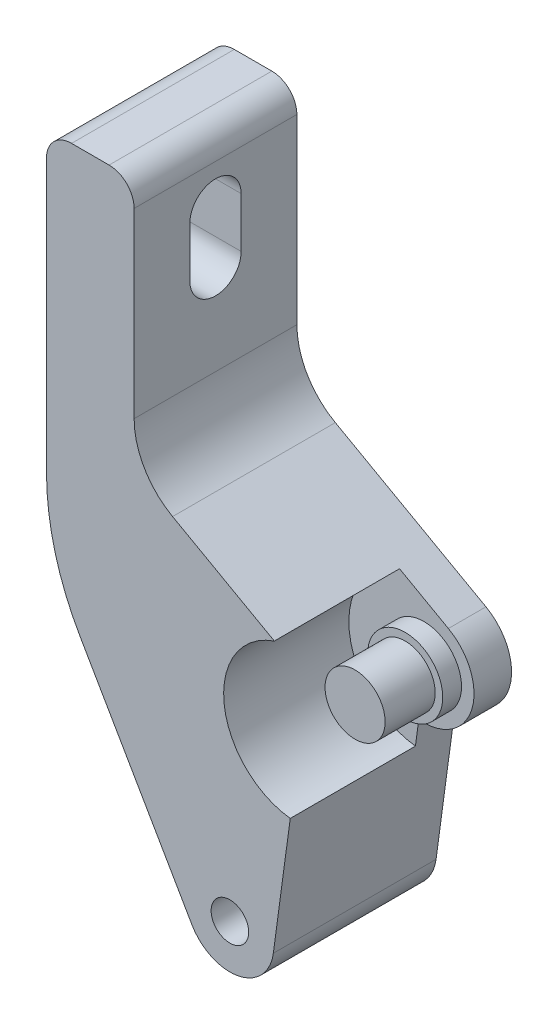
ISO-10303-21;
HEADER;
FILE_DESCRIPTION(('STEP AP214'),'2;1');
FILE_NAME('part.step','',(''),(''),'','','');
FILE_SCHEMA(('AUTOMOTIVE_DESIGN { 1 0 10303 214 1 1 1 1 }'));
ENDSEC;
DATA;
#1=APPLICATION_CONTEXT('core data for automotive mechanical design processes');
#2=APPLICATION_PROTOCOL_DEFINITION('international standard','automotive_design',2000,#1);
#3=PRODUCT_CONTEXT('',#1,'mechanical');
#4=PRODUCT('Part','Part','',(#3));
#5=PRODUCT_RELATED_PRODUCT_CATEGORY('part','',(#4));
#6=PRODUCT_DEFINITION_FORMATION('','',#4);
#7=PRODUCT_DEFINITION_CONTEXT('part definition',#1,'design');
#8=PRODUCT_DEFINITION('design','',#6,#7);
#9=PRODUCT_DEFINITION_SHAPE('','',#8);
#10=(LENGTH_UNIT() NAMED_UNIT(*) SI_UNIT(.MILLI.,.METRE.));
#11=(NAMED_UNIT(*) PLANE_ANGLE_UNIT() SI_UNIT($,.RADIAN.));
#12=(NAMED_UNIT(*) SI_UNIT($,.STERADIAN.) SOLID_ANGLE_UNIT());
#13=UNCERTAINTY_MEASURE_WITH_UNIT(LENGTH_MEASURE(1.E-05),#10,'distance_accuracy_value','');
#14=(GEOMETRIC_REPRESENTATION_CONTEXT(3) GLOBAL_UNCERTAINTY_ASSIGNED_CONTEXT((#13)) GLOBAL_UNIT_ASSIGNED_CONTEXT((#10,
#11,#12)) REPRESENTATION_CONTEXT('',''));
#15=CARTESIAN_POINT('',(0.,0.,0.));
#16=DIRECTION('',(0.,0.,1.));
#17=DIRECTION('',(1.,0.,0.));
#18=AXIS2_PLACEMENT_3D('',#15,#16,#17);
#19=CARTESIAN_POINT('',(-15.5,-15.5,3.));
#20=DIRECTION('',(0.,0.,1.));
#21=DIRECTION('',(1.,0.,0.));
#22=AXIS2_PLACEMENT_3D('',#19,#20,#21);
#23=PLANE('',#22);
#24=CARTESIAN_POINT('',(-10.,0.,3.));
#25=DIRECTION('',(0.,0.,1.));
#26=DIRECTION('',(1.,0.,0.));
#27=AXIS2_PLACEMENT_3D('',#24,#25,#26);
#28=CIRCLE('',#27,3.);
#29=CARTESIAN_POINT('',(-7.,0.,3.));
#30=VERTEX_POINT('',#29);
#31=EDGE_CURVE('E237',#30,#30,#28,.T.);
#32=ORIENTED_EDGE('',*,*,#31,.F.);
#33=EDGE_LOOP('',(#32));
#34=FACE_BOUND('',#33,.T.);
#35=DIRECTION('',(-0.872789761456183,0.488096335058213,0.));
#36=VECTOR('',#35,1.);
#37=CARTESIAN_POINT('',(-20.0785780103493,10.2193189967863,3.));
#38=LINE('',#37,#36);
#39=CARTESIAN_POINT('',(-8.04761465976715,3.49115904582473,3.));
#40=VERTEX_POINT('',#39);
#41=CARTESIAN_POINT('',(-11.9508491331308,5.67399221534209,3.));
#42=VERTEX_POINT('',#41);
#43=EDGE_CURVE('E252',#40,#42,#38,.T.);
#44=ORIENTED_EDGE('',*,*,#43,.T.);
#45=CARTESIAN_POINT('',(-10.,0.,3.));
#46=DIRECTION('',(0.,0.,-1.));
#47=DIRECTION('',(1.,0.,0.));
#48=AXIS2_PLACEMENT_3D('',#45,#46,#47);
#49=CIRCLE('',#48,6.);
#50=CARTESIAN_POINT('',(-10.6801845181552,-5.9613210802021,3.));
#51=VERTEX_POINT('',#50);
#52=EDGE_CURVE('E223',#51,#42,#49,.T.);
#53=ORIENTED_EDGE('',*,*,#52,.F.);
#54=DIRECTION('',(0.133819841401391,0.991005676092376,0.));
#55=VECTOR('',#54,1.);
#56=CARTESIAN_POINT('',(-12.0314801336767,-15.9683694449049,3.));
#57=LINE('',#56,#55);
#58=CARTESIAN_POINT('',(-10.4124595053815,-3.97867781510648,3.));
#59=VERTEX_POINT('',#58);
#60=EDGE_CURVE('E247',#51,#59,#57,.T.);
#61=ORIENTED_EDGE('',*,*,#60,.T.);
#62=CARTESIAN_POINT('',(-10.,0.,3.));
#63=DIRECTION('',(0.,0.,1.));
#64=DIRECTION('',(1.,0.,0.));
#65=AXIS2_PLACEMENT_3D('',#62,#63,#64);
#66=CIRCLE('',#65,4.);
#67=EDGE_CURVE('E249',#59,#40,#66,.T.);
#68=ORIENTED_EDGE('',*,*,#67,.T.);
#69=EDGE_LOOP('',(#44,#53,#61,#68));
#70=FACE_BOUND('',#69,.T.);
#71=ADVANCED_FACE('F35',(#34,#70),#23,.T.);
#72=CARTESIAN_POINT('',(0.,0.,4.5));
#73=DIRECTION('',(0.,0.,-1.));
#74=DIRECTION('',(-1.,0.,0.));
#75=AXIS2_PLACEMENT_3D('',#72,#73,#74);
#76=PLANE('',#75);
#77=CARTESIAN_POINT('',(-10.,0.,4.5));
#78=DIRECTION('',(0.,0.,-1.));
#79=DIRECTION('',(-1.,0.,0.));
#80=AXIS2_PLACEMENT_3D('',#77,#78,#79);
#81=CIRCLE('',#80,3.);
#82=CARTESIAN_POINT('',(-13.,0.,4.5));
#83=VERTEX_POINT('',#82);
#84=EDGE_CURVE('E240',#83,#83,#81,.T.);
#85=ORIENTED_EDGE('',*,*,#84,.F.);
#86=EDGE_LOOP('',(#85));
#87=FACE_BOUND('',#86,.T.);
#88=CARTESIAN_POINT('',(-10.,0.,4.5));
#89=DIRECTION('',(0.,0.,-1.));
#90=DIRECTION('',(-1.,0.,0.));
#91=AXIS2_PLACEMENT_3D('',#88,#89,#90);
#92=CIRCLE('',#91,2.4);
#93=CARTESIAN_POINT('',(-12.4,0.,4.5));
#94=VERTEX_POINT('',#93);
#95=EDGE_CURVE('E291',#94,#94,#92,.F.);
#96=ORIENTED_EDGE('',*,*,#95,.F.);
#97=EDGE_LOOP('',(#96));
#98=FACE_BOUND('',#97,.T.);
#99=ADVANCED_FACE('F379',(#87,#98),#76,.F.);
#100=CARTESIAN_POINT('',(-15.5,-15.5,0.));
#101=DIRECTION('',(0.,0.,1.));
#102=DIRECTION('',(1.,0.,0.));
#103=AXIS2_PLACEMENT_3D('',#100,#101,#102);
#104=PLANE('',#103);
#105=DIRECTION('',(-1.,0.,0.));
#106=VECTOR('',#105,1.);
#107=CARTESIAN_POINT('',(-30.15,32.,0.));
#108=LINE('',#107,#106);
#109=CARTESIAN_POINT('',(-25.15,32.,0.));
#110=VERTEX_POINT('',#109);
#111=CARTESIAN_POINT('',(-28.15,32.,0.));
#112=VERTEX_POINT('',#111);
#113=EDGE_CURVE('E268',#110,#112,#108,.T.);
#114=ORIENTED_EDGE('',*,*,#113,.F.);
#115=CARTESIAN_POINT('',(-25.15,30.,0.));
#116=DIRECTION('',(0.,0.,1.));
#117=DIRECTION('',(1.,0.,0.));
#118=AXIS2_PLACEMENT_3D('',#115,#116,#117);
#119=CIRCLE('',#118,2.);
#120=CARTESIAN_POINT('',(-23.15,30.,0.));
#121=VERTEX_POINT('',#120);
#122=EDGE_CURVE('E312',#110,#121,#119,.F.);
#123=ORIENTED_EDGE('',*,*,#122,.T.);
#124=DIRECTION('',(0.,1.,0.));
#125=VECTOR('',#124,1.);
#126=CARTESIAN_POINT('',(-23.15,32.,0.));
#127=LINE('',#126,#125);
#128=CARTESIAN_POINT('',(-23.15,15.4560575655234,0.));
#129=VERTEX_POINT('',#128);
#130=EDGE_CURVE('E265',#129,#121,#127,.T.);
#131=ORIENTED_EDGE('',*,*,#130,.F.);
#132=CARTESIAN_POINT('',(-17.15,15.4560575655234,0.));
#133=DIRECTION('',(0.,0.,-1.));
#134=DIRECTION('',(1.,0.,0.));
#135=AXIS2_PLACEMENT_3D('',#132,#133,#134);
#136=CIRCLE('',#135,5.99999999999999);
#137=CARTESIAN_POINT('',(-20.0785780103493,10.2193189967863,0.));
#138=VERTEX_POINT('',#137);
#139=EDGE_CURVE('E263',#138,#129,#136,.T.);
#140=ORIENTED_EDGE('',*,*,#139,.F.);
#141=DIRECTION('',(-0.872789761456183,0.488096335058213,0.));
#142=VECTOR('',#141,1.);
#143=CARTESIAN_POINT('',(-20.0785780103493,10.2193189967863,0.));
#144=LINE('',#143,#142);
#145=CARTESIAN_POINT('',(-8.04761465976715,3.49115904582473,0.));
#146=VERTEX_POINT('',#145);
#147=EDGE_CURVE('E261',#146,#138,#144,.T.);
#148=ORIENTED_EDGE('',*,*,#147,.F.);
#149=CARTESIAN_POINT('',(-10.,0.,0.));
#150=DIRECTION('',(0.,0.,1.));
#151=DIRECTION('',(1.,0.,0.));
#152=AXIS2_PLACEMENT_3D('',#149,#150,#151);
#153=CIRCLE('',#152,4.);
#154=CARTESIAN_POINT('',(-10.4124595053815,-3.97867781510648,0.));
#155=VERTEX_POINT('',#154);
#156=EDGE_CURVE('E259',#155,#146,#153,.T.);
#157=ORIENTED_EDGE('',*,*,#156,.F.);
#158=DIRECTION('',(0.133819841401391,0.991005676092376,0.));
#159=VECTOR('',#158,1.);
#160=CARTESIAN_POINT('',(-12.0314801336767,-15.9683694449049,0.));
#161=LINE('',#160,#159);
#162=CARTESIAN_POINT('',(-12.0314801336767,-15.9683694449049,0.));
#163=VERTEX_POINT('',#162);
#164=EDGE_CURVE('E257',#163,#155,#161,.T.);
#165=ORIENTED_EDGE('',*,*,#164,.F.);
#166=CARTESIAN_POINT('',(-15.5,-15.5,0.));
#167=DIRECTION('',(0.,0.,1.));
#168=DIRECTION('',(1.,0.,0.));
#169=AXIS2_PLACEMENT_3D('',#166,#167,#168);
#170=CIRCLE('',#169,3.5);
#171=CARTESIAN_POINT('',(-18.5310889132455,-17.25,0.));
#172=VERTEX_POINT('',#171);
#173=EDGE_CURVE('E246',#172,#163,#170,.T.);
#174=ORIENTED_EDGE('',*,*,#173,.F.);
#175=DIRECTION('',(0.500000000000004,-0.866025403784436,0.));
#176=VECTOR('',#175,1.);
#177=CARTESIAN_POINT('',(-18.5310889132455,-17.25,0.));
#178=LINE('',#177,#176);
#179=CARTESIAN_POINT('',(-27.4705080756887,-1.76647182049375,0.));
#180=VERTEX_POINT('',#179);
#181=EDGE_CURVE('E250',#180,#172,#178,.T.);
#182=ORIENTED_EDGE('',*,*,#181,.F.);
#183=CARTESIAN_POINT('',(-10.15,8.23352817950634,0.));
#184=DIRECTION('',(0.,0.,1.));
#185=DIRECTION('',(1.,0.,0.));
#186=AXIS2_PLACEMENT_3D('',#183,#184,#185);
#187=CIRCLE('',#186,20.);
#188=CARTESIAN_POINT('',(-30.15,8.23352817950635,0.));
#189=VERTEX_POINT('',#188);
#190=EDGE_CURVE('E297',#180,#189,#187,.F.);
#191=ORIENTED_EDGE('',*,*,#190,.T.);
#192=DIRECTION('',(0.,-1.,0.));
#193=VECTOR('',#192,1.);
#194=CARTESIAN_POINT('',(-30.15,2.87454433088383,0.));
#195=LINE('',#194,#193);
#196=CARTESIAN_POINT('',(-30.15,30.,0.));
#197=VERTEX_POINT('',#196);
#198=EDGE_CURVE('E271',#197,#189,#195,.T.);
#199=ORIENTED_EDGE('',*,*,#198,.F.);
#200=CARTESIAN_POINT('',(-28.15,30.,0.));
#201=DIRECTION('',(0.,0.,1.));
#202=DIRECTION('',(1.,0.,0.));
#203=AXIS2_PLACEMENT_3D('',#200,#201,#202);
#204=CIRCLE('',#203,2.);
#205=EDGE_CURVE('E310',#197,#112,#204,.F.);
#206=ORIENTED_EDGE('',*,*,#205,.T.);
#207=EDGE_LOOP('',(#114,#123,#131,#140,#148,#157,#165,#174,#182,#191,#199,#206));
#208=FACE_BOUND('',#207,.T.);
#209=CARTESIAN_POINT('',(-15.5,-15.5,0.));
#210=DIRECTION('',(0.,0.,1.));
#211=DIRECTION('',(1.,0.,0.));
#212=AXIS2_PLACEMENT_3D('',#209,#210,#211);
#213=CIRCLE('',#212,1.5);
#214=CARTESIAN_POINT('',(-14.,-15.5,0.));
#215=VERTEX_POINT('',#214);
#216=EDGE_CURVE('E243',#215,#215,#213,.T.);
#217=ORIENTED_EDGE('',*,*,#216,.T.);
#218=EDGE_LOOP('',(#217));
#219=FACE_BOUND('',#218,.T.);
#220=ADVANCED_FACE('F333',(#208,#219),#104,.F.);
#221=CARTESIAN_POINT('',(-15.5,-15.5,3.));
#222=DIRECTION('',(0.,0.,-1.));
#223=DIRECTION('',(-1.,0.,0.));
#224=AXIS2_PLACEMENT_3D('',#221,#222,#223);
#225=CYLINDRICAL_SURFACE('',#224,3.5);
#226=ORIENTED_EDGE('',*,*,#173,.T.);
#227=DIRECTION('',(0.,0.,-1.));
#228=VECTOR('',#227,1.);
#229=CARTESIAN_POINT('',(-12.0314801336767,-15.9683694449049,3.));
#230=LINE('',#229,#228);
#231=CARTESIAN_POINT('',(-12.0314801336767,-15.9683694449049,13.));
#232=VERTEX_POINT('',#231);
#233=EDGE_CURVE('E288',#232,#163,#230,.T.);
#234=ORIENTED_EDGE('',*,*,#233,.F.);
#235=CARTESIAN_POINT('',(-15.5,-15.5,13.));
#236=DIRECTION('',(0.,0.,1.));
#237=DIRECTION('',(1.,0.,0.));
#238=AXIS2_PLACEMENT_3D('',#235,#236,#237);
#239=CIRCLE('',#238,3.5);
#240=CARTESIAN_POINT('',(-18.5310889132455,-17.25,13.));
#241=VERTEX_POINT('',#240);
#242=EDGE_CURVE('E201',#241,#232,#239,.T.);
#243=ORIENTED_EDGE('',*,*,#242,.F.);
#244=DIRECTION('',(0.,0.,-1.));
#245=VECTOR('',#244,1.);
#246=CARTESIAN_POINT('',(-18.5310889132455,-17.25,3.));
#247=LINE('',#246,#245);
#248=EDGE_CURVE('E254',#241,#172,#247,.T.);
#249=ORIENTED_EDGE('',*,*,#248,.T.);
#250=EDGE_LOOP('',(#226,#234,#243,#249));
#251=FACE_BOUND('',#250,.T.);
#252=ADVANCED_FACE('F358',(#251),#225,.T.);
#253=CARTESIAN_POINT('',(-12.0314801336767,-15.9683694449049,3.));
#254=DIRECTION('',(-0.991005676092376,0.133819841401391,0.));
#255=DIRECTION('',(-0.133819841401391,-0.991005676092376,0.));
#256=AXIS2_PLACEMENT_3D('',#253,#254,#255);
#257=PLANE('',#256);
#258=ORIENTED_EDGE('',*,*,#164,.T.);
#259=DIRECTION('',(0.,0.,-1.));
#260=VECTOR('',#259,1.);
#261=CARTESIAN_POINT('',(-10.4124595053815,-3.97867781510648,3.));
#262=LINE('',#261,#260);
#263=EDGE_CURVE('E285',#59,#155,#262,.T.);
#264=ORIENTED_EDGE('',*,*,#263,.F.);
#265=ORIENTED_EDGE('',*,*,#60,.F.);
#266=DIRECTION('',(0.,0.,-1.));
#267=VECTOR('',#266,1.);
#268=CARTESIAN_POINT('',(-10.6801845181552,-5.96132108020211,73.5900514278663));
#269=LINE('',#268,#267);
#270=CARTESIAN_POINT('',(-10.6801845181552,-5.96132108020211,13.));
#271=VERTEX_POINT('',#270);
#272=EDGE_CURVE('E226',#271,#51,#269,.T.);
#273=ORIENTED_EDGE('',*,*,#272,.F.);
#274=DIRECTION('',(0.133819841401391,0.991005676092376,0.));
#275=VECTOR('',#274,1.);
#276=CARTESIAN_POINT('',(-12.0314801336767,-15.9683694449049,13.));
#277=LINE('',#276,#275);
#278=EDGE_CURVE('E198',#232,#271,#277,.T.);
#279=ORIENTED_EDGE('',*,*,#278,.F.);
#280=ORIENTED_EDGE('',*,*,#233,.T.);
#281=EDGE_LOOP('',(#258,#264,#265,#273,#279,#280));
#282=FACE_BOUND('',#281,.T.);
#283=ADVANCED_FACE('F353',(#282),#257,.F.);
#284=CARTESIAN_POINT('',(-10.,0.,3.));
#285=DIRECTION('',(0.,0.,-1.));
#286=DIRECTION('',(-1.,0.,0.));
#287=AXIS2_PLACEMENT_3D('',#284,#285,#286);
#288=CYLINDRICAL_SURFACE('',#287,4.);
#289=ORIENTED_EDGE('',*,*,#156,.T.);
#290=DIRECTION('',(0.,0.,-1.));
#291=VECTOR('',#290,1.);
#292=CARTESIAN_POINT('',(-8.04761465976715,3.49115904582473,3.));
#293=LINE('',#292,#291);
#294=EDGE_CURVE('E282',#40,#146,#293,.T.);
#295=ORIENTED_EDGE('',*,*,#294,.F.);
#296=ORIENTED_EDGE('',*,*,#67,.F.);
#297=ORIENTED_EDGE('',*,*,#263,.T.);
#298=EDGE_LOOP('',(#289,#295,#296,#297));
#299=FACE_BOUND('',#298,.T.);
#300=ADVANCED_FACE('F349',(#299),#288,.T.);
#301=CARTESIAN_POINT('',(-20.0785780103493,10.2193189967863,3.));
#302=DIRECTION('',(-0.488096335058213,-0.872789761456183,0.));
#303=DIRECTION('',(0.872789761456183,-0.488096335058213,0.));
#304=AXIS2_PLACEMENT_3D('',#301,#302,#303);
#305=PLANE('',#304);
#306=ORIENTED_EDGE('',*,*,#147,.T.);
#307=DIRECTION('',(0.,0.,-1.));
#308=VECTOR('',#307,1.);
#309=CARTESIAN_POINT('',(-20.0785780103493,10.2193189967863,3.));
#310=LINE('',#309,#308);
#311=CARTESIAN_POINT('',(-20.0785780103493,10.2193189967863,13.));
#312=VERTEX_POINT('',#311);
#313=EDGE_CURVE('E279',#312,#138,#310,.T.);
#314=ORIENTED_EDGE('',*,*,#313,.F.);
#315=DIRECTION('',(-0.872789761456183,0.488096335058213,0.));
#316=VECTOR('',#315,1.);
#317=CARTESIAN_POINT('',(-11.9508491331309,5.67399221534209,13.));
#318=LINE('',#317,#316);
#319=CARTESIAN_POINT('',(-11.9508491331309,5.67399221534209,13.));
#320=VERTEX_POINT('',#319);
#321=EDGE_CURVE('E217',#320,#312,#318,.T.);
#322=ORIENTED_EDGE('',*,*,#321,.F.);
#323=DIRECTION('',(0.,0.,-1.));
#324=VECTOR('',#323,1.);
#325=CARTESIAN_POINT('',(-11.9508491331309,5.67399221534209,73.5900514278663));
#326=LINE('',#325,#324);
#327=EDGE_CURVE('E229',#320,#42,#326,.T.);
#328=ORIENTED_EDGE('',*,*,#327,.T.);
#329=ORIENTED_EDGE('',*,*,#43,.F.);
#330=ORIENTED_EDGE('',*,*,#294,.T.);
#331=EDGE_LOOP('',(#306,#314,#322,#328,#329,#330));
#332=FACE_BOUND('',#331,.T.);
#333=ADVANCED_FACE('F344',(#332),#305,.F.);
#334=CARTESIAN_POINT('',(-17.15,15.4560575655234,3.));
#335=DIRECTION('',(0.,0.,-1.));
#336=DIRECTION('',(-1.,0.,0.));
#337=AXIS2_PLACEMENT_3D('',#334,#335,#336);
#338=CYLINDRICAL_SURFACE('',#337,5.99999999999999);
#339=ORIENTED_EDGE('',*,*,#139,.T.);
#340=DIRECTION('',(0.,0.,-1.));
#341=VECTOR('',#340,1.);
#342=CARTESIAN_POINT('',(-23.15,15.4560575655234,3.));
#343=LINE('',#342,#341);
#344=CARTESIAN_POINT('',(-23.15,15.4560575655234,13.));
#345=VERTEX_POINT('',#344);
#346=EDGE_CURVE('E276',#345,#129,#343,.T.);
#347=ORIENTED_EDGE('',*,*,#346,.F.);
#348=CARTESIAN_POINT('',(-17.15,15.4560575655234,13.));
#349=DIRECTION('',(0.,0.,1.));
#350=DIRECTION('',(1.,0.,0.));
#351=AXIS2_PLACEMENT_3D('',#348,#349,#350);
#352=CIRCLE('',#351,6.);
#353=EDGE_CURVE('E214',#312,#345,#352,.F.);
#354=ORIENTED_EDGE('',*,*,#353,.F.);
#355=ORIENTED_EDGE('',*,*,#313,.T.);
#356=EDGE_LOOP('',(#339,#347,#354,#355));
#357=FACE_BOUND('',#356,.T.);
#358=ADVANCED_FACE('F340',(#357),#338,.F.);
#359=CARTESIAN_POINT('',(-23.15,32.,3.));
#360=DIRECTION('',(-1.,0.,0.));
#361=DIRECTION('',(0.,0.,1.));
#362=AXIS2_PLACEMENT_3D('',#359,#360,#361);
#363=PLANE('',#362);
#364=DIRECTION('',(0.,1.,0.));
#365=VECTOR('',#364,1.);
#366=CARTESIAN_POINT('',(-23.15,32.,8.55));
#367=LINE('',#366,#365);
#368=CARTESIAN_POINT('',(-23.15,22.75,8.55));
#369=VERTEX_POINT('',#368);
#370=CARTESIAN_POINT('',(-23.15,26.75,8.55));
#371=VERTEX_POINT('',#370);
#372=EDGE_CURVE('E191',#369,#371,#367,.T.);
#373=ORIENTED_EDGE('',*,*,#372,.T.);
#374=CARTESIAN_POINT('',(-23.15,26.75,6.5));
#375=DIRECTION('',(-1.,0.,0.));
#376=DIRECTION('',(0.,0.,1.));
#377=AXIS2_PLACEMENT_3D('',#374,#375,#376);
#378=CIRCLE('',#377,2.05);
#379=CARTESIAN_POINT('',(-23.15,26.75,4.45));
#380=VERTEX_POINT('',#379);
#381=EDGE_CURVE('E194',#371,#380,#378,.T.);
#382=ORIENTED_EDGE('',*,*,#381,.T.);
#383=DIRECTION('',(0.,-1.,0.));
#384=VECTOR('',#383,1.);
#385=CARTESIAN_POINT('',(-23.15,32.,4.45));
#386=LINE('',#385,#384);
#387=CARTESIAN_POINT('',(-23.15,22.75,4.45));
#388=VERTEX_POINT('',#387);
#389=EDGE_CURVE('E186',#380,#388,#386,.T.);
#390=ORIENTED_EDGE('',*,*,#389,.T.);
#391=CARTESIAN_POINT('',(-23.15,22.75,6.5));
#392=DIRECTION('',(-1.,0.,0.));
#393=DIRECTION('',(0.,0.,1.));
#394=AXIS2_PLACEMENT_3D('',#391,#392,#393);
#395=CIRCLE('',#394,2.05);
#396=EDGE_CURVE('E166',#388,#369,#395,.T.);
#397=ORIENTED_EDGE('',*,*,#396,.T.);
#398=EDGE_LOOP('',(#373,#382,#390,#397));
#399=FACE_BOUND('',#398,.T.);
#400=ORIENTED_EDGE('',*,*,#130,.T.);
#401=DIRECTION('',(0.,0.,-1.));
#402=VECTOR('',#401,1.);
#403=CARTESIAN_POINT('',(-23.15,30.,3.));
#404=LINE('',#403,#402);
#405=CARTESIAN_POINT('',(-23.15,30.,13.));
#406=VERTEX_POINT('',#405);
#407=EDGE_CURVE('E314',#121,#406,#404,.F.);
#408=ORIENTED_EDGE('',*,*,#407,.T.);
#409=DIRECTION('',(0.,1.,0.));
#410=VECTOR('',#409,1.);
#411=CARTESIAN_POINT('',(-23.15,15.4560575655234,13.));
#412=LINE('',#411,#410);
#413=EDGE_CURVE('E211',#345,#406,#412,.T.);
#414=ORIENTED_EDGE('',*,*,#413,.F.);
#415=ORIENTED_EDGE('',*,*,#346,.T.);
#416=EDGE_LOOP('',(#400,#408,#414,#415));
#417=FACE_BOUND('',#416,.T.);
#418=ADVANCED_FACE('F337',(#399,#417),#363,.F.);
#419=CARTESIAN_POINT('',(-30.15,32.,3.));
#420=DIRECTION('',(0.,-1.,0.));
#421=DIRECTION('',(0.,0.,-1.));
#422=AXIS2_PLACEMENT_3D('',#419,#420,#421);
#423=PLANE('',#422);
#424=DIRECTION('',(-1.,0.,0.));
#425=VECTOR('',#424,1.);
#426=CARTESIAN_POINT('',(-23.15,32.,13.));
#427=LINE('',#426,#425);
#428=CARTESIAN_POINT('',(-25.15,32.,13.));
#429=VERTEX_POINT('',#428);
#430=CARTESIAN_POINT('',(-28.15,32.,13.));
#431=VERTEX_POINT('',#430);
#432=EDGE_CURVE('E208',#429,#431,#427,.T.);
#433=ORIENTED_EDGE('',*,*,#432,.F.);
#434=DIRECTION('',(0.,0.,-1.));
#435=VECTOR('',#434,1.);
#436=CARTESIAN_POINT('',(-25.15,32.,3.));
#437=LINE('',#436,#435);
#438=EDGE_CURVE('E307',#429,#110,#437,.T.);
#439=ORIENTED_EDGE('',*,*,#438,.T.);
#440=ORIENTED_EDGE('',*,*,#113,.T.);
#441=DIRECTION('',(0.,0.,-1.));
#442=VECTOR('',#441,1.);
#443=CARTESIAN_POINT('',(-28.15,32.,3.));
#444=LINE('',#443,#442);
#445=EDGE_CURVE('E305',#112,#431,#444,.F.);
#446=ORIENTED_EDGE('',*,*,#445,.T.);
#447=EDGE_LOOP('',(#433,#439,#440,#446));
#448=FACE_BOUND('',#447,.T.);
#449=ADVANCED_FACE('F327',(#448),#423,.F.);
#450=CARTESIAN_POINT('',(-30.15,2.87454433088383,3.));
#451=DIRECTION('',(1.,0.,0.));
#452=DIRECTION('',(0.,1.,0.));
#453=AXIS2_PLACEMENT_3D('',#450,#451,#452);
#454=PLANE('',#453);
#455=DIRECTION('',(0.,-1.,0.));
#456=VECTOR('',#455,1.);
#457=CARTESIAN_POINT('',(-30.15,26.75,4.45));
#458=LINE('',#457,#456);
#459=CARTESIAN_POINT('',(-30.15,26.75,4.45));
#460=VERTEX_POINT('',#459);
#461=CARTESIAN_POINT('',(-30.15,22.75,4.45));
#462=VERTEX_POINT('',#461);
#463=EDGE_CURVE('E172',#460,#462,#458,.T.);
#464=ORIENTED_EDGE('',*,*,#463,.F.);
#465=CARTESIAN_POINT('',(-30.15,26.75,6.5));
#466=DIRECTION('',(-1.,0.,0.));
#467=DIRECTION('',(0.,0.,1.));
#468=AXIS2_PLACEMENT_3D('',#465,#466,#467);
#469=CIRCLE('',#468,2.05);
#470=CARTESIAN_POINT('',(-30.15,26.75,8.55));
#471=VERTEX_POINT('',#470);
#472=EDGE_CURVE('E58',#471,#460,#469,.T.);
#473=ORIENTED_EDGE('',*,*,#472,.F.);
#474=DIRECTION('',(0.,1.,0.));
#475=VECTOR('',#474,1.);
#476=CARTESIAN_POINT('',(-30.15,26.75,8.55));
#477=LINE('',#476,#475);
#478=CARTESIAN_POINT('',(-30.15,22.75,8.55));
#479=VERTEX_POINT('',#478);
#480=EDGE_CURVE('E179',#479,#471,#477,.T.);
#481=ORIENTED_EDGE('',*,*,#480,.F.);
#482=CARTESIAN_POINT('',(-30.15,22.75,6.5));
#483=DIRECTION('',(-1.,0.,0.));
#484=DIRECTION('',(0.,0.,1.));
#485=AXIS2_PLACEMENT_3D('',#482,#483,#484);
#486=CIRCLE('',#485,2.05);
#487=EDGE_CURVE('E163',#462,#479,#486,.T.);
#488=ORIENTED_EDGE('',*,*,#487,.F.);
#489=EDGE_LOOP('',(#464,#473,#481,#488));
#490=FACE_BOUND('',#489,.T.);
#491=DIRECTION('',(0.,-1.,0.));
#492=VECTOR('',#491,1.);
#493=CARTESIAN_POINT('',(-30.15,32.,13.));
#494=LINE('',#493,#492);
#495=CARTESIAN_POINT('',(-30.15,30.,13.));
#496=VERTEX_POINT('',#495);
#497=CARTESIAN_POINT('',(-30.15,8.23352817950635,13.));
#498=VERTEX_POINT('',#497);
#499=EDGE_CURVE('E206',#496,#498,#494,.T.);
#500=ORIENTED_EDGE('',*,*,#499,.F.);
#501=DIRECTION('',(0.,0.,-1.));
#502=VECTOR('',#501,1.);
#503=CARTESIAN_POINT('',(-30.15,30.,3.));
#504=LINE('',#503,#502);
#505=EDGE_CURVE('E12',#496,#197,#504,.T.);
#506=ORIENTED_EDGE('',*,*,#505,.T.);
#507=ORIENTED_EDGE('',*,*,#198,.T.);
#508=DIRECTION('',(0.,0.,-1.));
#509=VECTOR('',#508,1.);
#510=CARTESIAN_POINT('',(-30.15,8.23352817950635,3.));
#511=LINE('',#510,#509);
#512=EDGE_CURVE('E300',#189,#498,#511,.F.);
#513=ORIENTED_EDGE('',*,*,#512,.T.);
#514=EDGE_LOOP('',(#500,#506,#507,#513));
#515=FACE_BOUND('',#514,.T.);
#516=ADVANCED_FACE('F176',(#490,#515),#454,.F.);
#517=CARTESIAN_POINT('',(-18.5310889132455,-17.25,3.));
#518=DIRECTION('',(0.866025403784436,0.500000000000004,0.));
#519=DIRECTION('',(-0.500000000000004,0.866025403784436,0.));
#520=AXIS2_PLACEMENT_3D('',#517,#518,#519);
#521=PLANE('',#520);
#522=DIRECTION('',(0.500000000000004,-0.866025403784436,0.));
#523=VECTOR('',#522,1.);
#524=CARTESIAN_POINT('',(-30.15,2.87454433088383,13.));
#525=LINE('',#524,#523);
#526=CARTESIAN_POINT('',(-27.4705080756887,-1.76647182049375,13.));
#527=VERTEX_POINT('',#526);
#528=EDGE_CURVE('E204',#527,#241,#525,.T.);
#529=ORIENTED_EDGE('',*,*,#528,.F.);
#530=DIRECTION('',(0.,0.,-1.));
#531=VECTOR('',#530,1.);
#532=CARTESIAN_POINT('',(-27.4705080756887,-1.76647182049375,3.));
#533=LINE('',#532,#531);
#534=EDGE_CURVE('E294',#527,#180,#533,.T.);
#535=ORIENTED_EDGE('',*,*,#534,.T.);
#536=ORIENTED_EDGE('',*,*,#181,.T.);
#537=ORIENTED_EDGE('',*,*,#248,.F.);
#538=EDGE_LOOP('',(#529,#535,#536,#537));
#539=FACE_BOUND('',#538,.T.);
#540=ADVANCED_FACE('F363',(#539),#521,.F.);
#541=CARTESIAN_POINT('',(-15.5,-15.5,3.));
#542=DIRECTION('',(0.,0.,-1.));
#543=DIRECTION('',(-1.,0.,0.));
#544=AXIS2_PLACEMENT_3D('',#541,#542,#543);
#545=CYLINDRICAL_SURFACE('',#544,1.5);
#546=ORIENTED_EDGE('',*,*,#216,.F.);
#547=EDGE_LOOP('',(#546));
#548=FACE_BOUND('',#547,.T.);
#549=CARTESIAN_POINT('',(-15.5,-15.5,13.));
#550=DIRECTION('',(0.,0.,1.));
#551=DIRECTION('',(1.,0.,0.));
#552=AXIS2_PLACEMENT_3D('',#549,#550,#551);
#553=CIRCLE('',#552,1.5);
#554=CARTESIAN_POINT('',(-14.,-15.5,13.));
#555=VERTEX_POINT('',#554);
#556=EDGE_CURVE('E197',#555,#555,#553,.T.);
#557=ORIENTED_EDGE('',*,*,#556,.T.);
#558=EDGE_LOOP('',(#557));
#559=FACE_BOUND('',#558,.T.);
#560=ADVANCED_FACE('F390',(#548,#559),#545,.F.);
#561=CARTESIAN_POINT('',(-10.,0.,14.9852813742386));
#562=DIRECTION('',(0.,0.,-1.));
#563=DIRECTION('',(-1.,0.,0.));
#564=AXIS2_PLACEMENT_3D('',#561,#562,#563);
#565=CYLINDRICAL_SURFACE('',#564,3.);
#566=ORIENTED_EDGE('',*,*,#84,.T.);
#567=EDGE_LOOP('',(#566));
#568=FACE_BOUND('',#567,.T.);
#569=ORIENTED_EDGE('',*,*,#31,.T.);
#570=EDGE_LOOP('',(#569));
#571=FACE_BOUND('',#570,.T.);
#572=ADVANCED_FACE('F443',(#568,#571),#565,.T.);
#573=CARTESIAN_POINT('',(-10.,0.,17.2882250993909));
#574=DIRECTION('',(0.,0.,-1.));
#575=DIRECTION('',(-1.,0.,0.));
#576=AXIS2_PLACEMENT_3D('',#573,#574,#575);
#577=CYLINDRICAL_SURFACE('',#576,2.4);
#578=CARTESIAN_POINT('',(-10.,0.,8.5));
#579=DIRECTION('',(0.,0.,-1.));
#580=DIRECTION('',(-1.,0.,0.));
#581=AXIS2_PLACEMENT_3D('',#578,#579,#580);
#582=CIRCLE('',#581,2.4);
#583=CARTESIAN_POINT('',(-12.4,0.,8.5));
#584=VERTEX_POINT('',#583);
#585=EDGE_CURVE('E232',#584,#584,#582,.T.);
#586=ORIENTED_EDGE('',*,*,#585,.T.);
#587=EDGE_LOOP('',(#586));
#588=FACE_BOUND('',#587,.T.);
#589=ORIENTED_EDGE('',*,*,#95,.T.);
#590=EDGE_LOOP('',(#589));
#591=FACE_BOUND('',#590,.T.);
#592=ADVANCED_FACE('F440',(#588,#591),#577,.T.);
#593=CARTESIAN_POINT('',(0.,0.,8.5));
#594=DIRECTION('',(0.,0.,-1.));
#595=DIRECTION('',(-1.,0.,0.));
#596=AXIS2_PLACEMENT_3D('',#593,#594,#595);
#597=PLANE('',#596);
#598=ORIENTED_EDGE('',*,*,#585,.F.);
#599=EDGE_LOOP('',(#598));
#600=FACE_BOUND('',#599,.T.);
#601=ADVANCED_FACE('F437',(#600),#597,.F.);
#602=CARTESIAN_POINT('',(-10.,0.,73.5900514278663));
#603=DIRECTION('',(0.,0.,-1.));
#604=DIRECTION('',(-1.,0.,0.));
#605=AXIS2_PLACEMENT_3D('',#602,#603,#604);
#606=CYLINDRICAL_SURFACE('',#605,6.);
#607=CARTESIAN_POINT('',(-10.,0.,13.));
#608=DIRECTION('',(0.,0.,1.));
#609=DIRECTION('',(1.,0.,0.));
#610=AXIS2_PLACEMENT_3D('',#607,#608,#609);
#611=CIRCLE('',#610,6.);
#612=EDGE_CURVE('E220',#271,#320,#611,.F.);
#613=ORIENTED_EDGE('',*,*,#612,.F.);
#614=ORIENTED_EDGE('',*,*,#272,.T.);
#615=ORIENTED_EDGE('',*,*,#52,.T.);
#616=ORIENTED_EDGE('',*,*,#327,.F.);
#617=EDGE_LOOP('',(#613,#614,#615,#616));
#618=FACE_BOUND('',#617,.T.);
#619=ADVANCED_FACE('F376',(#618),#606,.F.);
#620=CARTESIAN_POINT('',(0.,0.,13.));
#621=DIRECTION('',(0.,0.,1.));
#622=DIRECTION('',(1.,0.,0.));
#623=AXIS2_PLACEMENT_3D('',#620,#621,#622);
#624=PLANE('',#623);
#625=ORIENTED_EDGE('',*,*,#556,.F.);
#626=EDGE_LOOP('',(#625));
#627=FACE_BOUND('',#626,.T.);
#628=ORIENTED_EDGE('',*,*,#413,.T.);
#629=CARTESIAN_POINT('',(-25.15,30.,13.));
#630=DIRECTION('',(0.,0.,1.));
#631=DIRECTION('',(1.,0.,0.));
#632=AXIS2_PLACEMENT_3D('',#629,#630,#631);
#633=CIRCLE('',#632,2.);
#634=EDGE_CURVE('E43',#406,#429,#633,.T.);
#635=ORIENTED_EDGE('',*,*,#634,.T.);
#636=ORIENTED_EDGE('',*,*,#432,.T.);
#637=CARTESIAN_POINT('',(-28.15,30.,13.));
#638=DIRECTION('',(0.,0.,1.));
#639=DIRECTION('',(1.,0.,0.));
#640=AXIS2_PLACEMENT_3D('',#637,#638,#639);
#641=CIRCLE('',#640,2.);
#642=EDGE_CURVE('E316',#431,#496,#641,.T.);
#643=ORIENTED_EDGE('',*,*,#642,.T.);
#644=ORIENTED_EDGE('',*,*,#499,.T.);
#645=CARTESIAN_POINT('',(-10.15,8.23352817950634,13.));
#646=DIRECTION('',(0.,0.,1.));
#647=DIRECTION('',(1.,0.,0.));
#648=AXIS2_PLACEMENT_3D('',#645,#646,#647);
#649=CIRCLE('',#648,20.);
#650=EDGE_CURVE('E303',#498,#527,#649,.T.);
#651=ORIENTED_EDGE('',*,*,#650,.T.);
#652=ORIENTED_EDGE('',*,*,#528,.T.);
#653=ORIENTED_EDGE('',*,*,#242,.T.);
#654=ORIENTED_EDGE('',*,*,#278,.T.);
#655=ORIENTED_EDGE('',*,*,#612,.T.);
#656=ORIENTED_EDGE('',*,*,#321,.T.);
#657=ORIENTED_EDGE('',*,*,#353,.T.);
#658=EDGE_LOOP('',(#628,#635,#636,#643,#644,#651,#652,#653,#654,#655,#656,#657));
#659=FACE_BOUND('',#658,.T.);
#660=ADVANCED_FACE('F320',(#627,#659),#624,.T.);
#661=CARTESIAN_POINT('',(-10.15,8.23352817950634,3.));
#662=DIRECTION('',(0.,0.,-1.));
#663=DIRECTION('',(-1.,0.,0.));
#664=AXIS2_PLACEMENT_3D('',#661,#662,#663);
#665=CYLINDRICAL_SURFACE('',#664,20.);
#666=ORIENTED_EDGE('',*,*,#650,.F.);
#667=ORIENTED_EDGE('',*,*,#512,.F.);
#668=ORIENTED_EDGE('',*,*,#190,.F.);
#669=ORIENTED_EDGE('',*,*,#534,.F.);
#670=EDGE_LOOP('',(#666,#667,#668,#669));
#671=FACE_BOUND('',#670,.T.);
#672=ADVANCED_FACE('F367',(#671),#665,.T.);
#673=CARTESIAN_POINT('',(-25.15,30.,3.));
#674=DIRECTION('',(0.,0.,-1.));
#675=DIRECTION('',(-1.,0.,0.));
#676=AXIS2_PLACEMENT_3D('',#673,#674,#675);
#677=CYLINDRICAL_SURFACE('',#676,2.);
#678=ORIENTED_EDGE('',*,*,#634,.F.);
#679=ORIENTED_EDGE('',*,*,#407,.F.);
#680=ORIENTED_EDGE('',*,*,#122,.F.);
#681=ORIENTED_EDGE('',*,*,#438,.F.);
#682=EDGE_LOOP('',(#678,#679,#680,#681));
#683=FACE_BOUND('',#682,.T.);
#684=ADVANCED_FACE('F330',(#683),#677,.T.);
#685=CARTESIAN_POINT('',(-28.15,30.,3.));
#686=DIRECTION('',(0.,0.,-1.));
#687=DIRECTION('',(-1.,0.,0.));
#688=AXIS2_PLACEMENT_3D('',#685,#686,#687);
#689=CYLINDRICAL_SURFACE('',#688,2.);
#690=ORIENTED_EDGE('',*,*,#642,.F.);
#691=ORIENTED_EDGE('',*,*,#445,.F.);
#692=ORIENTED_EDGE('',*,*,#205,.F.);
#693=ORIENTED_EDGE('',*,*,#505,.F.);
#694=EDGE_LOOP('',(#690,#691,#692,#693));
#695=FACE_BOUND('',#694,.T.);
#696=ADVANCED_FACE('F37',(#695),#689,.T.);
#697=CARTESIAN_POINT('',(-6.,26.75,6.5));
#698=DIRECTION('',(-1.,0.,0.));
#699=DIRECTION('',(0.,0.,1.));
#700=AXIS2_PLACEMENT_3D('',#697,#698,#699);
#701=CYLINDRICAL_SURFACE('',#700,2.05);
#702=DIRECTION('',(-1.,0.,0.));
#703=VECTOR('',#702,1.);
#704=CARTESIAN_POINT('',(-6.,26.75,8.55));
#705=LINE('',#704,#703);
#706=EDGE_CURVE('E184',#371,#471,#705,.T.);
#707=ORIENTED_EDGE('',*,*,#706,.T.);
#708=ORIENTED_EDGE('',*,*,#472,.T.);
#709=DIRECTION('',(-1.,0.,0.));
#710=VECTOR('',#709,1.);
#711=CARTESIAN_POINT('',(-6.,26.75,4.45));
#712=LINE('',#711,#710);
#713=EDGE_CURVE('E169',#380,#460,#712,.T.);
#714=ORIENTED_EDGE('',*,*,#713,.F.);
#715=ORIENTED_EDGE('',*,*,#381,.F.);
#716=EDGE_LOOP('',(#707,#708,#714,#715));
#717=FACE_BOUND('',#716,.T.);
#718=ADVANCED_FACE('F418',(#717),#701,.F.);
#719=CARTESIAN_POINT('',(-6.,26.75,8.55));
#720=DIRECTION('',(0.,0.,1.));
#721=DIRECTION('',(0.,-1.,0.));
#722=AXIS2_PLACEMENT_3D('',#719,#720,#721);
#723=PLANE('',#722);
#724=DIRECTION('',(-1.,0.,0.));
#725=VECTOR('',#724,1.);
#726=CARTESIAN_POINT('',(-6.,22.75,8.55));
#727=LINE('',#726,#725);
#728=EDGE_CURVE('E168',#369,#479,#727,.T.);
#729=ORIENTED_EDGE('',*,*,#728,.T.);
#730=ORIENTED_EDGE('',*,*,#480,.T.);
#731=ORIENTED_EDGE('',*,*,#706,.F.);
#732=ORIENTED_EDGE('',*,*,#372,.F.);
#733=EDGE_LOOP('',(#729,#730,#731,#732));
#734=FACE_BOUND('',#733,.T.);
#735=ADVANCED_FACE('F422',(#734),#723,.F.);
#736=CARTESIAN_POINT('',(-6.,22.75,6.5));
#737=DIRECTION('',(-1.,0.,0.));
#738=DIRECTION('',(0.,0.,1.));
#739=AXIS2_PLACEMENT_3D('',#736,#737,#738);
#740=CYLINDRICAL_SURFACE('',#739,2.05);
#741=DIRECTION('',(-1.,0.,0.));
#742=VECTOR('',#741,1.);
#743=CARTESIAN_POINT('',(-6.,22.75,4.45));
#744=LINE('',#743,#742);
#745=EDGE_CURVE('E50',#388,#462,#744,.T.);
#746=ORIENTED_EDGE('',*,*,#745,.T.);
#747=ORIENTED_EDGE('',*,*,#487,.T.);
#748=ORIENTED_EDGE('',*,*,#728,.F.);
#749=ORIENTED_EDGE('',*,*,#396,.F.);
#750=EDGE_LOOP('',(#746,#747,#748,#749));
#751=FACE_BOUND('',#750,.T.);
#752=ADVANCED_FACE('F160',(#751),#740,.F.);
#753=CARTESIAN_POINT('',(-6.,26.75,4.45));
#754=DIRECTION('',(0.,0.,-1.));
#755=DIRECTION('',(0.,1.,0.));
#756=AXIS2_PLACEMENT_3D('',#753,#754,#755);
#757=PLANE('',#756);
#758=ORIENTED_EDGE('',*,*,#713,.T.);
#759=ORIENTED_EDGE('',*,*,#463,.T.);
#760=ORIENTED_EDGE('',*,*,#745,.F.);
#761=ORIENTED_EDGE('',*,*,#389,.F.);
#762=EDGE_LOOP('',(#758,#759,#760,#761));
#763=FACE_BOUND('',#762,.T.);
#764=ADVANCED_FACE('F173',(#763),#757,.F.);
#765=CLOSED_SHELL('',(#71,#99,#220,#252,#283,#300,#333,#358,#418,#449,#516,#540,#560,#572,#592,
#601,#619,#660,#672,#684,#696,#718,#735,#752,#764));
#766=MANIFOLD_SOLID_BREP('B2',#765);
#767=ADVANCED_BREP_SHAPE_REPRESENTATION('',(#18,#766),#14);
#768=SHAPE_DEFINITION_REPRESENTATION(#9,#767);
ENDSEC;
END-ISO-10303-21;
